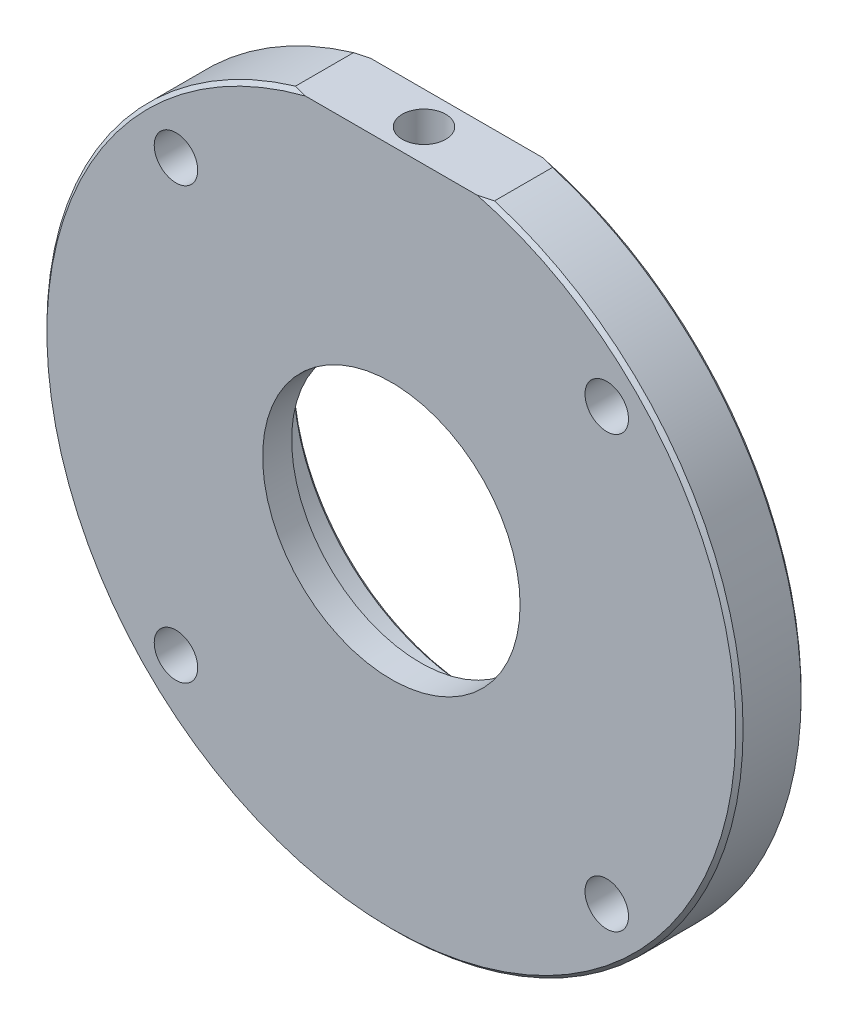
ISO-10303-21;
HEADER;
FILE_DESCRIPTION(('STEP AP214'),'2;1');
FILE_NAME('part.step','',(''),(''),'','','');
FILE_SCHEMA(('AUTOMOTIVE_DESIGN { 1 0 10303 214 1 1 1 1 }'));
ENDSEC;
DATA;
#1=APPLICATION_CONTEXT('core data for automotive mechanical design processes');
#2=APPLICATION_PROTOCOL_DEFINITION('international standard','automotive_design',2000,#1);
#3=PRODUCT_CONTEXT('',#1,'mechanical');
#4=PRODUCT('Part','Part','',(#3));
#5=PRODUCT_RELATED_PRODUCT_CATEGORY('part','',(#4));
#6=PRODUCT_DEFINITION_FORMATION('','',#4);
#7=PRODUCT_DEFINITION_CONTEXT('part definition',#1,'design');
#8=PRODUCT_DEFINITION('design','',#6,#7);
#9=PRODUCT_DEFINITION_SHAPE('','',#8);
#10=(LENGTH_UNIT() NAMED_UNIT(*) SI_UNIT(.MILLI.,.METRE.));
#11=(NAMED_UNIT(*) PLANE_ANGLE_UNIT() SI_UNIT($,.RADIAN.));
#12=(NAMED_UNIT(*) SI_UNIT($,.STERADIAN.) SOLID_ANGLE_UNIT());
#13=UNCERTAINTY_MEASURE_WITH_UNIT(LENGTH_MEASURE(1.E-05),#10,'distance_accuracy_value','');
#14=(GEOMETRIC_REPRESENTATION_CONTEXT(3) GLOBAL_UNCERTAINTY_ASSIGNED_CONTEXT((#13)) GLOBAL_UNIT_ASSIGNED_CONTEXT((#10,
#11,#12)) REPRESENTATION_CONTEXT('',''));
#15=CARTESIAN_POINT('',(0.,0.,0.));
#16=DIRECTION('',(0.,0.,1.));
#17=DIRECTION('',(1.,0.,0.));
#18=AXIS2_PLACEMENT_3D('',#15,#16,#17);
#19=CARTESIAN_POINT('',(0.,0.,0.));
#20=DIRECTION('',(0.,0.,1.));
#21=DIRECTION('',(1.,0.,0.));
#22=AXIS2_PLACEMENT_3D('',#19,#20,#21);
#23=CYLINDRICAL_SURFACE('',#22,17.75);
#24=CARTESIAN_POINT('',(0.,0.,-4.00000000000001));
#25=DIRECTION('',(0.,0.,1.));
#26=DIRECTION('',(1.,0.,0.));
#27=AXIS2_PLACEMENT_3D('',#24,#25,#26);
#28=CIRCLE('',#27,17.75);
#29=CARTESIAN_POINT('',(17.75,0.,-4.00000000000001));
#30=VERTEX_POINT('',#29);
#31=EDGE_CURVE('E209',#30,#30,#28,.T.);
#32=ORIENTED_EDGE('',*,*,#31,.F.);
#33=EDGE_LOOP('',(#32));
#34=FACE_BOUND('',#33,.T.);
#35=CARTESIAN_POINT('',(0.,0.,0.));
#36=DIRECTION('',(0.,0.,1.));
#37=DIRECTION('',(1.,0.,0.));
#38=AXIS2_PLACEMENT_3D('',#35,#36,#37);
#39=CIRCLE('',#38,17.75);
#40=CARTESIAN_POINT('',(17.75,0.,0.));
#41=VERTEX_POINT('',#40);
#42=EDGE_CURVE('E99',#41,#41,#39,.T.);
#43=ORIENTED_EDGE('',*,*,#42,.T.);
#44=EDGE_LOOP('',(#43));
#45=FACE_BOUND('',#44,.T.);
#46=ADVANCED_FACE('F41',(#34,#45),#23,.F.);
#47=CARTESIAN_POINT('',(0.,17.75,0.));
#48=DIRECTION('',(0.,0.,-1.));
#49=DIRECTION('',(-1.,0.,0.));
#50=AXIS2_PLACEMENT_3D('',#47,#48,#49);
#51=PLANE('',#50);
#52=CARTESIAN_POINT('',(29.698484809835,29.698484809835,0.));
#53=DIRECTION('',(0.,0.,-1.));
#54=DIRECTION('',(-1.,0.,0.));
#55=AXIS2_PLACEMENT_3D('',#52,#53,#54);
#56=CIRCLE('',#55,2.99999999999995);
#57=CARTESIAN_POINT('',(26.6984848098351,29.698484809835,0.));
#58=VERTEX_POINT('',#57);
#59=EDGE_CURVE('E308',#58,#58,#56,.T.);
#60=ORIENTED_EDGE('',*,*,#59,.T.);
#61=EDGE_LOOP('',(#60));
#62=FACE_BOUND('',#61,.T.);
#63=CARTESIAN_POINT('',(29.698484809835,-29.698484809835,0.));
#64=DIRECTION('',(0.,0.,-1.));
#65=DIRECTION('',(-1.,0.,0.));
#66=AXIS2_PLACEMENT_3D('',#63,#64,#65);
#67=CIRCLE('',#66,3.00000000000005);
#68=CARTESIAN_POINT('',(26.698484809835,-29.698484809835,0.));
#69=VERTEX_POINT('',#68);
#70=EDGE_CURVE('E302',#69,#69,#67,.T.);
#71=ORIENTED_EDGE('',*,*,#70,.T.);
#72=EDGE_LOOP('',(#71));
#73=FACE_BOUND('',#72,.T.);
#74=CARTESIAN_POINT('',(-29.698484809835,-29.698484809835,0.));
#75=DIRECTION('',(0.,0.,-1.));
#76=DIRECTION('',(-1.,0.,0.));
#77=AXIS2_PLACEMENT_3D('',#74,#75,#76);
#78=CIRCLE('',#77,3.00000000000008);
#79=CARTESIAN_POINT('',(-32.6984848098351,-29.698484809835,0.));
#80=VERTEX_POINT('',#79);
#81=EDGE_CURVE('E296',#80,#80,#78,.T.);
#82=ORIENTED_EDGE('',*,*,#81,.T.);
#83=EDGE_LOOP('',(#82));
#84=FACE_BOUND('',#83,.T.);
#85=CARTESIAN_POINT('',(-29.698484809835,29.698484809835,0.));
#86=DIRECTION('',(0.,0.,-1.));
#87=DIRECTION('',(-1.,0.,0.));
#88=AXIS2_PLACEMENT_3D('',#85,#86,#87);
#89=CIRCLE('',#88,2.99999999999996);
#90=CARTESIAN_POINT('',(-32.698484809835,29.698484809835,0.));
#91=VERTEX_POINT('',#90);
#92=EDGE_CURVE('E210',#91,#91,#89,.T.);
#93=ORIENTED_EDGE('',*,*,#92,.T.);
#94=EDGE_LOOP('',(#93));
#95=FACE_BOUND('',#94,.T.);
#96=ORIENTED_EDGE('',*,*,#42,.F.);
#97=EDGE_LOOP('',(#96));
#98=FACE_BOUND('',#97,.T.);
#99=DIRECTION('',(-1.,0.,0.));
#100=VECTOR('',#99,1.);
#101=CARTESIAN_POINT('',(13.7113092008021,46.,0.));
#102=LINE('',#101,#100);
#103=CARTESIAN_POINT('',(11.8427192823269,46.,0.));
#104=VERTEX_POINT('',#103);
#105=CARTESIAN_POINT('',(-11.8427192823269,46.,0.));
#106=VERTEX_POINT('',#105);
#107=EDGE_CURVE('E232',#104,#106,#102,.T.);
#108=ORIENTED_EDGE('',*,*,#107,.T.);
#109=CARTESIAN_POINT('',(0.,0.,0.));
#110=DIRECTION('',(0.,0.,-1.));
#111=DIRECTION('',(-1.,0.,0.));
#112=AXIS2_PLACEMENT_3D('',#109,#110,#111);
#113=CIRCLE('',#112,47.5);
#114=EDGE_CURVE('E103',#106,#104,#113,.F.);
#115=ORIENTED_EDGE('',*,*,#114,.T.);
#116=EDGE_LOOP('',(#108,#115));
#117=FACE_BOUND('',#116,.T.);
#118=ADVANCED_FACE('F163',(#62,#73,#84,#95,#98,#117),#51,.F.);
#119=CARTESIAN_POINT('',(0.,0.,0.));
#120=DIRECTION('',(0.,0.,1.));
#121=DIRECTION('',(1.,0.,0.));
#122=AXIS2_PLACEMENT_3D('',#119,#120,#121);
#123=CYLINDRICAL_SURFACE('',#122,48.);
#124=DIRECTION('',(0.,0.,-1.));
#125=VECTOR('',#124,1.);
#126=CARTESIAN_POINT('',(13.7113092008021,46.,0.));
#127=LINE('',#126,#125);
#128=CARTESIAN_POINT('',(13.7113092008021,46.,-0.500000000000035));
#129=VERTEX_POINT('',#128);
#130=CARTESIAN_POINT('',(13.7113092008021,46.,-8.50000000000001));
#131=VERTEX_POINT('',#130);
#132=EDGE_CURVE('E234',#129,#131,#127,.T.);
#133=ORIENTED_EDGE('',*,*,#132,.F.);
#134=CARTESIAN_POINT('',(0.,0.,-0.500000000000035));
#135=DIRECTION('',(0.,0.,-1.));
#136=DIRECTION('',(-1.,0.,0.));
#137=AXIS2_PLACEMENT_3D('',#134,#135,#136);
#138=CIRCLE('',#137,48.);
#139=CARTESIAN_POINT('',(-13.7113092008021,46.,-0.500000000000035));
#140=VERTEX_POINT('',#139);
#141=EDGE_CURVE('E239',#129,#140,#138,.T.);
#142=ORIENTED_EDGE('',*,*,#141,.T.);
#143=DIRECTION('',(0.,0.,-1.));
#144=VECTOR('',#143,1.);
#145=CARTESIAN_POINT('',(-13.7113092008021,46.,0.));
#146=LINE('',#145,#144);
#147=CARTESIAN_POINT('',(-13.7113092008021,46.,-8.50000000000001));
#148=VERTEX_POINT('',#147);
#149=EDGE_CURVE('E313',#140,#148,#146,.T.);
#150=ORIENTED_EDGE('',*,*,#149,.T.);
#151=CARTESIAN_POINT('',(0.,0.,-8.50000000000001));
#152=DIRECTION('',(0.,0.,1.));
#153=DIRECTION('',(1.,0.,0.));
#154=AXIS2_PLACEMENT_3D('',#151,#152,#153);
#155=CIRCLE('',#154,48.);
#156=EDGE_CURVE('E240',#148,#131,#155,.T.);
#157=ORIENTED_EDGE('',*,*,#156,.T.);
#158=EDGE_LOOP('',(#133,#142,#150,#157));
#159=FACE_BOUND('',#158,.T.);
#160=ADVANCED_FACE('F167',(#159),#123,.T.);
#161=CARTESIAN_POINT('',(0.,48.,-9.));
#162=DIRECTION('',(0.,0.,1.));
#163=DIRECTION('',(1.,0.,0.));
#164=AXIS2_PLACEMENT_3D('',#161,#162,#163);
#165=PLANE('',#164);
#166=CARTESIAN_POINT('',(29.698484809835,29.698484809835,-9.));
#167=DIRECTION('',(0.,0.,-1.));
#168=DIRECTION('',(-1.,0.,0.));
#169=AXIS2_PLACEMENT_3D('',#166,#167,#168);
#170=CIRCLE('',#169,2.99999999999995);
#171=CARTESIAN_POINT('',(26.6984848098351,29.698484809835,-9.));
#172=VERTEX_POINT('',#171);
#173=EDGE_CURVE('E311',#172,#172,#170,.T.);
#174=ORIENTED_EDGE('',*,*,#173,.F.);
#175=EDGE_LOOP('',(#174));
#176=FACE_BOUND('',#175,.T.);
#177=CARTESIAN_POINT('',(29.698484809835,-29.698484809835,-9.));
#178=DIRECTION('',(0.,0.,-1.));
#179=DIRECTION('',(-1.,0.,0.));
#180=AXIS2_PLACEMENT_3D('',#177,#178,#179);
#181=CIRCLE('',#180,3.00000000000005);
#182=CARTESIAN_POINT('',(26.698484809835,-29.698484809835,-9.));
#183=VERTEX_POINT('',#182);
#184=EDGE_CURVE('E305',#183,#183,#181,.T.);
#185=ORIENTED_EDGE('',*,*,#184,.F.);
#186=EDGE_LOOP('',(#185));
#187=FACE_BOUND('',#186,.T.);
#188=CARTESIAN_POINT('',(-29.698484809835,-29.698484809835,-9.));
#189=DIRECTION('',(0.,0.,-1.));
#190=DIRECTION('',(-1.,0.,0.));
#191=AXIS2_PLACEMENT_3D('',#188,#189,#190);
#192=CIRCLE('',#191,3.00000000000008);
#193=CARTESIAN_POINT('',(-32.6984848098351,-29.698484809835,-9.));
#194=VERTEX_POINT('',#193);
#195=EDGE_CURVE('E299',#194,#194,#192,.T.);
#196=ORIENTED_EDGE('',*,*,#195,.F.);
#197=EDGE_LOOP('',(#196));
#198=FACE_BOUND('',#197,.T.);
#199=CARTESIAN_POINT('',(-29.698484809835,29.698484809835,-9.));
#200=DIRECTION('',(0.,0.,-1.));
#201=DIRECTION('',(-1.,0.,0.));
#202=AXIS2_PLACEMENT_3D('',#199,#200,#201);
#203=CIRCLE('',#202,2.99999999999996);
#204=CARTESIAN_POINT('',(-32.698484809835,29.698484809835,-9.));
#205=VERTEX_POINT('',#204);
#206=EDGE_CURVE('E215',#205,#205,#203,.T.);
#207=ORIENTED_EDGE('',*,*,#206,.F.);
#208=EDGE_LOOP('',(#207));
#209=FACE_BOUND('',#208,.T.);
#210=DIRECTION('',(-1.,0.,0.));
#211=VECTOR('',#210,1.);
#212=CARTESIAN_POINT('',(13.7113092008021,46.,-9.));
#213=LINE('',#212,#211);
#214=CARTESIAN_POINT('',(11.8427192823271,46.,-9.));
#215=VERTEX_POINT('',#214);
#216=CARTESIAN_POINT('',(-11.8427192823271,46.,-9.));
#217=VERTEX_POINT('',#216);
#218=EDGE_CURVE('E235',#215,#217,#213,.T.);
#219=ORIENTED_EDGE('',*,*,#218,.F.);
#220=CARTESIAN_POINT('',(0.,0.,-9.));
#221=DIRECTION('',(0.,0.,1.));
#222=DIRECTION('',(1.,0.,0.));
#223=AXIS2_PLACEMENT_3D('',#220,#221,#222);
#224=CIRCLE('',#223,47.5);
#225=EDGE_CURVE('E242',#215,#217,#224,.F.);
#226=ORIENTED_EDGE('',*,*,#225,.T.);
#227=EDGE_LOOP('',(#219,#226));
#228=FACE_BOUND('',#227,.T.);
#229=CARTESIAN_POINT('',(0.,0.,-9.));
#230=DIRECTION('',(0.,0.,1.));
#231=DIRECTION('',(1.,0.,0.));
#232=AXIS2_PLACEMENT_3D('',#229,#230,#231);
#233=CIRCLE('',#232,36.);
#234=CARTESIAN_POINT('',(36.,0.,-9.));
#235=VERTEX_POINT('',#234);
#236=EDGE_CURVE('E224',#235,#235,#233,.T.);
#237=ORIENTED_EDGE('',*,*,#236,.T.);
#238=EDGE_LOOP('',(#237));
#239=FACE_BOUND('',#238,.T.);
#240=ADVANCED_FACE('F171',(#176,#187,#198,#209,#228,#239),#165,.F.);
#241=CARTESIAN_POINT('',(0.,0.,0.));
#242=DIRECTION('',(0.,0.,1.));
#243=DIRECTION('',(1.,0.,0.));
#244=AXIS2_PLACEMENT_3D('',#241,#242,#243);
#245=CYLINDRICAL_SURFACE('',#244,36.);
#246=CARTESIAN_POINT('',(0.,0.,-13.5));
#247=DIRECTION('',(0.,0.,1.));
#248=DIRECTION('',(1.,0.,0.));
#249=AXIS2_PLACEMENT_3D('',#246,#247,#248);
#250=CIRCLE('',#249,36.);
#251=CARTESIAN_POINT('',(36.,0.,-13.5));
#252=VERTEX_POINT('',#251);
#253=EDGE_CURVE('E50',#252,#252,#250,.T.);
#254=ORIENTED_EDGE('',*,*,#253,.T.);
#255=EDGE_LOOP('',(#254));
#256=FACE_BOUND('',#255,.T.);
#257=ORIENTED_EDGE('',*,*,#236,.F.);
#258=EDGE_LOOP('',(#257));
#259=FACE_BOUND('',#258,.T.);
#260=ADVANCED_FACE('F175',(#256,#259),#245,.T.);
#261=CARTESIAN_POINT('',(0.,36.,-14.));
#262=DIRECTION('',(0.,0.,1.));
#263=DIRECTION('',(1.,0.,0.));
#264=AXIS2_PLACEMENT_3D('',#261,#262,#263);
#265=PLANE('',#264);
#266=CARTESIAN_POINT('',(0.,0.,-14.));
#267=DIRECTION('',(0.,0.,1.));
#268=DIRECTION('',(1.,0.,0.));
#269=AXIS2_PLACEMENT_3D('',#266,#267,#268);
#270=CIRCLE('',#269,35.5);
#271=CARTESIAN_POINT('',(35.5,0.,-14.));
#272=VERTEX_POINT('',#271);
#273=EDGE_CURVE('E11',#272,#272,#270,.F.);
#274=ORIENTED_EDGE('',*,*,#273,.T.);
#275=EDGE_LOOP('',(#274));
#276=FACE_BOUND('',#275,.T.);
#277=CARTESIAN_POINT('',(0.,0.,-14.));
#278=DIRECTION('',(0.,0.,1.));
#279=DIRECTION('',(1.,0.,0.));
#280=AXIS2_PLACEMENT_3D('',#277,#278,#279);
#281=CIRCLE('',#280,30.);
#282=CARTESIAN_POINT('',(30.,0.,-14.));
#283=VERTEX_POINT('',#282);
#284=EDGE_CURVE('E221',#283,#283,#281,.T.);
#285=ORIENTED_EDGE('',*,*,#284,.T.);
#286=EDGE_LOOP('',(#285));
#287=FACE_BOUND('',#286,.T.);
#288=ADVANCED_FACE('F179',(#276,#287),#265,.F.);
#289=CARTESIAN_POINT('',(0.,0.,0.));
#290=DIRECTION('',(0.,0.,1.));
#291=DIRECTION('',(1.,0.,0.));
#292=AXIS2_PLACEMENT_3D('',#289,#290,#291);
#293=CYLINDRICAL_SURFACE('',#292,30.);
#294=ORIENTED_EDGE('',*,*,#284,.F.);
#295=EDGE_LOOP('',(#294));
#296=FACE_BOUND('',#295,.T.);
#297=CARTESIAN_POINT('',(0.,0.,-12.));
#298=DIRECTION('',(0.,0.,1.));
#299=DIRECTION('',(1.,0.,0.));
#300=AXIS2_PLACEMENT_3D('',#297,#298,#299);
#301=CIRCLE('',#300,30.);
#302=CARTESIAN_POINT('',(30.,0.,-12.));
#303=VERTEX_POINT('',#302);
#304=EDGE_CURVE('E212',#303,#303,#301,.T.);
#305=ORIENTED_EDGE('',*,*,#304,.T.);
#306=EDGE_LOOP('',(#305));
#307=FACE_BOUND('',#306,.T.);
#308=ADVANCED_FACE('F183',(#296,#307),#293,.F.);
#309=CARTESIAN_POINT('',(0.,30.,-12.));
#310=DIRECTION('',(0.,0.,1.));
#311=DIRECTION('',(1.,0.,0.));
#312=AXIS2_PLACEMENT_3D('',#309,#310,#311);
#313=PLANE('',#312);
#314=CARTESIAN_POINT('',(0.,0.,-12.));
#315=DIRECTION('',(0.,0.,1.));
#316=DIRECTION('',(1.,0.,0.));
#317=AXIS2_PLACEMENT_3D('',#314,#315,#316);
#318=CIRCLE('',#317,25.5);
#319=CARTESIAN_POINT('',(25.5,0.,-12.));
#320=VERTEX_POINT('',#319);
#321=EDGE_CURVE('E246',#320,#320,#318,.T.);
#322=ORIENTED_EDGE('',*,*,#321,.T.);
#323=EDGE_LOOP('',(#322));
#324=FACE_BOUND('',#323,.T.);
#325=CARTESIAN_POINT('',(0.,28.,-12.));
#326=DIRECTION('',(0.,0.,-1.));
#327=DIRECTION('',(-1.,0.,0.));
#328=AXIS2_PLACEMENT_3D('',#325,#326,#327);
#329=CIRCLE('',#328,1.5);
#330=CARTESIAN_POINT('',(-1.5,28.,-12.));
#331=VERTEX_POINT('',#330);
#332=EDGE_CURVE('E284',#331,#331,#329,.T.);
#333=ORIENTED_EDGE('',*,*,#332,.F.);
#334=EDGE_LOOP('',(#333));
#335=FACE_BOUND('',#334,.T.);
#336=ORIENTED_EDGE('',*,*,#304,.F.);
#337=EDGE_LOOP('',(#336));
#338=FACE_BOUND('',#337,.T.);
#339=ADVANCED_FACE('F187',(#324,#335,#338),#313,.F.);
#340=CARTESIAN_POINT('',(0.,0.,0.));
#341=DIRECTION('',(0.,0.,1.));
#342=DIRECTION('',(1.,0.,0.));
#343=AXIS2_PLACEMENT_3D('',#340,#341,#342);
#344=CYLINDRICAL_SURFACE('',#343,25.);
#345=CARTESIAN_POINT('',(0.,0.,-11.5));
#346=DIRECTION('',(0.,0.,1.));
#347=DIRECTION('',(1.,0.,0.));
#348=AXIS2_PLACEMENT_3D('',#345,#346,#347);
#349=CIRCLE('',#348,25.);
#350=CARTESIAN_POINT('',(25.,0.,-11.5));
#351=VERTEX_POINT('',#350);
#352=EDGE_CURVE('E249',#351,#351,#349,.F.);
#353=ORIENTED_EDGE('',*,*,#352,.T.);
#354=EDGE_LOOP('',(#353));
#355=FACE_BOUND('',#354,.T.);
#356=CARTESIAN_POINT('',(0.,0.,-4.00000000000001));
#357=DIRECTION('',(0.,0.,1.));
#358=DIRECTION('',(1.,0.,0.));
#359=AXIS2_PLACEMENT_3D('',#356,#357,#358);
#360=CIRCLE('',#359,25.);
#361=CARTESIAN_POINT('',(25.,0.,-4.00000000000001));
#362=VERTEX_POINT('',#361);
#363=EDGE_CURVE('E206',#362,#362,#360,.T.);
#364=ORIENTED_EDGE('',*,*,#363,.T.);
#365=EDGE_LOOP('',(#364));
#366=FACE_BOUND('',#365,.T.);
#367=ADVANCED_FACE('F191',(#355,#366),#344,.F.);
#368=CARTESIAN_POINT('',(0.,25.,-4.00000000000001));
#369=DIRECTION('',(0.,0.,1.));
#370=DIRECTION('',(1.,0.,0.));
#371=AXIS2_PLACEMENT_3D('',#368,#369,#370);
#372=PLANE('',#371);
#373=ORIENTED_EDGE('',*,*,#363,.F.);
#374=EDGE_LOOP('',(#373));
#375=FACE_BOUND('',#374,.T.);
#376=ORIENTED_EDGE('',*,*,#31,.T.);
#377=EDGE_LOOP('',(#376));
#378=FACE_BOUND('',#377,.T.);
#379=ADVANCED_FACE('F194',(#375,#378),#372,.F.);
#380=CARTESIAN_POINT('',(-29.698484809835,29.698484809835,0.));
#381=DIRECTION('',(0.,0.,-1.));
#382=DIRECTION('',(-1.,0.,0.));
#383=AXIS2_PLACEMENT_3D('',#380,#381,#382);
#384=CYLINDRICAL_SURFACE('',#383,2.99999999999996);
#385=ORIENTED_EDGE('',*,*,#92,.F.);
#386=EDGE_LOOP('',(#385));
#387=FACE_BOUND('',#386,.T.);
#388=ORIENTED_EDGE('',*,*,#206,.T.);
#389=EDGE_LOOP('',(#388));
#390=FACE_BOUND('',#389,.T.);
#391=ADVANCED_FACE('F135',(#387,#390),#384,.F.);
#392=CARTESIAN_POINT('',(-29.698484809835,-29.698484809835,0.));
#393=DIRECTION('',(0.,0.,-1.));
#394=DIRECTION('',(-1.,0.,0.));
#395=AXIS2_PLACEMENT_3D('',#392,#393,#394);
#396=CYLINDRICAL_SURFACE('',#395,3.00000000000008);
#397=ORIENTED_EDGE('',*,*,#81,.F.);
#398=EDGE_LOOP('',(#397));
#399=FACE_BOUND('',#398,.T.);
#400=ORIENTED_EDGE('',*,*,#195,.T.);
#401=EDGE_LOOP('',(#400));
#402=FACE_BOUND('',#401,.T.);
#403=ADVANCED_FACE('F201',(#399,#402),#396,.F.);
#404=CARTESIAN_POINT('',(29.698484809835,-29.698484809835,0.));
#405=DIRECTION('',(0.,0.,-1.));
#406=DIRECTION('',(-1.,0.,0.));
#407=AXIS2_PLACEMENT_3D('',#404,#405,#406);
#408=CYLINDRICAL_SURFACE('',#407,3.00000000000005);
#409=ORIENTED_EDGE('',*,*,#70,.F.);
#410=EDGE_LOOP('',(#409));
#411=FACE_BOUND('',#410,.T.);
#412=ORIENTED_EDGE('',*,*,#184,.T.);
#413=EDGE_LOOP('',(#412));
#414=FACE_BOUND('',#413,.T.);
#415=ADVANCED_FACE('F336',(#411,#414),#408,.F.);
#416=CARTESIAN_POINT('',(29.698484809835,29.698484809835,0.));
#417=DIRECTION('',(0.,0.,-1.));
#418=DIRECTION('',(-1.,0.,0.));
#419=AXIS2_PLACEMENT_3D('',#416,#417,#418);
#420=CYLINDRICAL_SURFACE('',#419,2.99999999999995);
#421=ORIENTED_EDGE('',*,*,#59,.F.);
#422=EDGE_LOOP('',(#421));
#423=FACE_BOUND('',#422,.T.);
#424=ORIENTED_EDGE('',*,*,#173,.T.);
#425=EDGE_LOOP('',(#424));
#426=FACE_BOUND('',#425,.T.);
#427=ADVANCED_FACE('F132',(#423,#426),#420,.F.);
#428=CARTESIAN_POINT('',(13.7113092008021,46.,0.));
#429=DIRECTION('',(0.,-1.,0.));
#430=DIRECTION('',(0.,0.,-1.));
#431=AXIS2_PLACEMENT_3D('',#428,#429,#430);
#432=PLANE('',#431);
#433=CARTESIAN_POINT('',(0.,46.,-4.5));
#434=DIRECTION('',(0.,1.,0.));
#435=DIRECTION('',(0.,0.,1.));
#436=AXIS2_PLACEMENT_3D('',#433,#434,#435);
#437=CIRCLE('',#436,3.);
#438=CARTESIAN_POINT('',(0.,46.,-1.5));
#439=VERTEX_POINT('',#438);
#440=EDGE_CURVE('E365',#439,#439,#437,.T.);
#441=ORIENTED_EDGE('',*,*,#440,.F.);
#442=EDGE_LOOP('',(#441));
#443=FACE_BOUND('',#442,.T.);
#444=ORIENTED_EDGE('',*,*,#107,.F.);
#445=CARTESIAN_POINT('',(11.8427192823269,46.,0.));
#446=CARTESIAN_POINT('',(11.9991388188031,46.,-0.0389985230280838));
#447=CARTESIAN_POINT('',(12.1553880653659,46.,-0.0786793241775536));
#448=CARTESIAN_POINT('',(12.4675283278574,46.,-0.159380356325894));
#449=CARTESIAN_POINT('',(12.6234193687162,46.,-0.200400490890134));
#450=CARTESIAN_POINT('',(12.9348478472471,46.,-0.283760620168467));
#451=CARTESIAN_POINT('',(13.0903852853711,46.,-0.326100613194369));
#452=CARTESIAN_POINT('',(13.4011123370387,46.,-0.412081144543513));
#453=CARTESIAN_POINT('',(13.5563019247885,46.,-0.45572177609113));
#454=CARTESIAN_POINT('',(13.7113092008021,46.,-0.500000000000035));
#455=B_SPLINE_CURVE_WITH_KNOTS('',3,(#445,#446,#447,#448,#449,#450,#451,#452,#453,#454),
.UNSPECIFIED.,.F.,.F.,(4,2,2,2,4),(0.,0.483621622500473,0.967208499754799,1.45079475849337,
1.93441576244599),.UNSPECIFIED.);
#456=EDGE_CURVE('E65',#104,#129,#455,.T.);
#457=ORIENTED_EDGE('',*,*,#456,.T.);
#458=ORIENTED_EDGE('',*,*,#132,.T.);
#459=CARTESIAN_POINT('',(13.7113092008021,46.,-8.50000000000001));
#460=CARTESIAN_POINT('',(13.5563019247885,46.,-8.5442782239089));
#461=CARTESIAN_POINT('',(13.4011123370387,46.,-8.58791885545652));
#462=CARTESIAN_POINT('',(13.0903852853711,46.,-8.67389938680565));
#463=CARTESIAN_POINT('',(12.9348478472471,46.,-8.71623937983155));
#464=CARTESIAN_POINT('',(12.6234193687163,46.,-8.79959950910987));
#465=CARTESIAN_POINT('',(12.4675283278575,46.,-8.84061964367411));
#466=CARTESIAN_POINT('',(12.155388065366,46.,-8.92132067582244));
#467=CARTESIAN_POINT('',(11.9991388188032,46.,-8.96100147697191));
#468=CARTESIAN_POINT('',(11.8427192823271,46.,-8.99999999999999));
#469=B_SPLINE_CURVE_WITH_KNOTS('',3,(#459,#460,#461,#462,#463,#464,#465,#466,#467,#468),
.UNSPECIFIED.,.F.,.F.,(4,2,2,2,4),(0.,0.483621003952566,0.967207262691103,1.45079413994539,
1.93441576244582),.UNSPECIFIED.);
#470=EDGE_CURVE('E57',#131,#215,#469,.T.);
#471=ORIENTED_EDGE('',*,*,#470,.T.);
#472=ORIENTED_EDGE('',*,*,#218,.T.);
#473=CARTESIAN_POINT('',(-11.8427192823271,46.,-9.));
#474=CARTESIAN_POINT('',(-11.9991388188032,46.,-8.96100147697191));
#475=CARTESIAN_POINT('',(-12.155388065366,46.,-8.92132067582244));
#476=CARTESIAN_POINT('',(-12.4675283278575,46.,-8.84061964367411));
#477=CARTESIAN_POINT('',(-12.6234193687163,46.,-8.79959950910987));
#478=CARTESIAN_POINT('',(-12.9348478472471,46.,-8.71623937983155));
#479=CARTESIAN_POINT('',(-13.0903852853711,46.,-8.67389938680565));
#480=CARTESIAN_POINT('',(-13.4011123370387,46.,-8.58791885545652));
#481=CARTESIAN_POINT('',(-13.5563019247885,46.,-8.5442782239089));
#482=CARTESIAN_POINT('',(-13.7113092008021,46.,-8.50000000000001));
#483=B_SPLINE_CURVE_WITH_KNOTS('',3,(#473,#474,#475,#476,#477,#478,#479,#480,#481,#482),
.UNSPECIFIED.,.F.,.F.,(4,2,2,2,4),(0.,0.483621622500432,0.967208499754714,1.45079475849325,
1.93441576244582),.UNSPECIFIED.);
#484=EDGE_CURVE('E106',#217,#148,#483,.T.);
#485=ORIENTED_EDGE('',*,*,#484,.T.);
#486=ORIENTED_EDGE('',*,*,#149,.F.);
#487=CARTESIAN_POINT('',(-13.7113092008021,46.,-0.500000000000035));
#488=CARTESIAN_POINT('',(-13.5563019247885,46.,-0.45572177609113));
#489=CARTESIAN_POINT('',(-13.4011123370387,46.,-0.412081144543513));
#490=CARTESIAN_POINT('',(-13.0903852853711,46.,-0.326100613194369));
#491=CARTESIAN_POINT('',(-12.9348478472471,46.,-0.283760620168467));
#492=CARTESIAN_POINT('',(-12.6234193687162,46.,-0.200400490890134));
#493=CARTESIAN_POINT('',(-12.4675283278574,46.,-0.159380356325894));
#494=CARTESIAN_POINT('',(-12.1553880653659,46.,-0.0786793241775533));
#495=CARTESIAN_POINT('',(-11.9991388188031,46.,-0.0389985230280822));
#496=CARTESIAN_POINT('',(-11.8427192823269,46.,0.));
#497=B_SPLINE_CURVE_WITH_KNOTS('',3,(#487,#488,#489,#490,#491,#492,#493,#494,#495,#496),
.UNSPECIFIED.,.F.,.F.,(4,2,2,2,4),(0.,0.483621003952611,0.967207262691188,1.45079413994552,
1.93441576244599),.UNSPECIFIED.);
#498=EDGE_CURVE('E141',#140,#106,#497,.T.);
#499=ORIENTED_EDGE('',*,*,#498,.T.);
#500=EDGE_LOOP('',(#444,#457,#458,#471,#472,#485,#486,#499));
#501=FACE_BOUND('',#500,.T.);
#502=ADVANCED_FACE('F126',(#443,#501),#432,.F.);
#503=CARTESIAN_POINT('',(0.,28.,-1.90129092854134));
#504=DIRECTION('',(0.,0.,-1.));
#505=DIRECTION('',(-1.,0.,0.));
#506=AXIS2_PLACEMENT_3D('',#503,#504,#505);
#507=CONICAL_SURFACE('',#506,1.5,1.02974425867665);
#508=CARTESIAN_POINT('',(0.,28.,-1.));
#509=VERTEX_POINT('',#508);
#510=VERTEX_LOOP('',#509);
#511=FACE_BOUND('',#510,.T.);
#512=CARTESIAN_POINT('',(0.,28.,-1.90129092854134));
#513=DIRECTION('',(0.,0.,-1.));
#514=DIRECTION('',(-1.,0.,0.));
#515=AXIS2_PLACEMENT_3D('',#512,#513,#514);
#516=CIRCLE('',#515,1.5);
#517=CARTESIAN_POINT('',(-1.5,28.,-1.90129092854134));
#518=VERTEX_POINT('',#517);
#519=EDGE_CURVE('E286',#518,#518,#516,.T.);
#520=ORIENTED_EDGE('',*,*,#519,.T.);
#521=EDGE_LOOP('',(#520));
#522=FACE_BOUND('',#521,.T.);
#523=ADVANCED_FACE('F131',(#511,#522),#507,.F.);
#524=CARTESIAN_POINT('',(0.,28.,-12.));
#525=DIRECTION('',(0.,0.,-1.));
#526=DIRECTION('',(-1.,0.,0.));
#527=AXIS2_PLACEMENT_3D('',#524,#525,#526);
#528=CYLINDRICAL_SURFACE('',#527,1.5);
#529=CARTESIAN_POINT('',(0.,28.,-4.5));
#530=DIRECTION('',(0.,-0.707106781186547,-0.707106781186547));
#531=DIRECTION('',(0.,0.707106781186547,-0.707106781186547));
#532=AXIS2_PLACEMENT_3D('',#529,#530,#531);
#533=ELLIPSE('',#532,2.12132034355964,1.5);
#534=CARTESIAN_POINT('',(1.5,28.,-4.5));
#535=VERTEX_POINT('',#534);
#536=CARTESIAN_POINT('',(-1.5,28.,-4.5));
#537=VERTEX_POINT('',#536);
#538=EDGE_CURVE('E93',#535,#537,#533,.F.);
#539=ORIENTED_EDGE('',*,*,#538,.T.);
#540=CARTESIAN_POINT('',(0.,28.,-4.5));
#541=DIRECTION('',(0.,0.707106781186547,-0.707106781186547));
#542=DIRECTION('',(0.,-0.707106781186547,-0.707106781186547));
#543=AXIS2_PLACEMENT_3D('',#540,#541,#542);
#544=ELLIPSE('',#543,2.12132034355964,1.5);
#545=EDGE_CURVE('E97',#537,#535,#544,.T.);
#546=ORIENTED_EDGE('',*,*,#545,.T.);
#547=EDGE_LOOP('',(#539,#546));
#548=FACE_BOUND('',#547,.T.);
#549=ORIENTED_EDGE('',*,*,#519,.F.);
#550=EDGE_LOOP('',(#549));
#551=FACE_BOUND('',#550,.T.);
#552=ORIENTED_EDGE('',*,*,#332,.T.);
#553=EDGE_LOOP('',(#552));
#554=FACE_BOUND('',#553,.T.);
#555=ADVANCED_FACE('F101',(#548,#551,#554),#528,.F.);
#556=CARTESIAN_POINT('',(0.,46.,-4.5));
#557=DIRECTION('',(0.,1.,0.));
#558=DIRECTION('',(0.,0.,1.));
#559=AXIS2_PLACEMENT_3D('',#556,#557,#558);
#560=CYLINDRICAL_SURFACE('',#559,1.5);
#561=ORIENTED_EDGE('',*,*,#538,.F.);
#562=ORIENTED_EDGE('',*,*,#545,.F.);
#563=EDGE_LOOP('',(#561,#562));
#564=FACE_BOUND('',#563,.T.);
#565=CARTESIAN_POINT('',(0.,39.,-4.5));
#566=DIRECTION('',(0.,1.,0.));
#567=DIRECTION('',(0.,0.,1.));
#568=AXIS2_PLACEMENT_3D('',#565,#566,#567);
#569=CIRCLE('',#568,1.5);
#570=CARTESIAN_POINT('',(0.,39.,-3.));
#571=VERTEX_POINT('',#570);
#572=EDGE_CURVE('E287',#571,#571,#569,.T.);
#573=ORIENTED_EDGE('',*,*,#572,.T.);
#574=EDGE_LOOP('',(#573));
#575=FACE_BOUND('',#574,.T.);
#576=ADVANCED_FACE('F95',(#564,#575),#560,.F.);
#577=CARTESIAN_POINT('',(1.5,39.,-4.5));
#578=DIRECTION('',(0.,-1.,0.));
#579=DIRECTION('',(0.,0.,-1.));
#580=AXIS2_PLACEMENT_3D('',#577,#578,#579);
#581=PLANE('',#580);
#582=ORIENTED_EDGE('',*,*,#572,.F.);
#583=EDGE_LOOP('',(#582));
#584=FACE_BOUND('',#583,.T.);
#585=CARTESIAN_POINT('',(0.,39.,-4.5));
#586=DIRECTION('',(0.,1.,0.));
#587=DIRECTION('',(0.,0.,1.));
#588=AXIS2_PLACEMENT_3D('',#585,#586,#587);
#589=CIRCLE('',#588,3.);
#590=CARTESIAN_POINT('',(0.,39.,-1.5));
#591=VERTEX_POINT('',#590);
#592=EDGE_CURVE('E292',#591,#591,#589,.T.);
#593=ORIENTED_EDGE('',*,*,#592,.T.);
#594=EDGE_LOOP('',(#593));
#595=FACE_BOUND('',#594,.T.);
#596=ADVANCED_FACE('F352',(#584,#595),#581,.F.);
#597=CARTESIAN_POINT('',(0.,46.,-4.5));
#598=DIRECTION('',(0.,1.,0.));
#599=DIRECTION('',(0.,0.,1.));
#600=AXIS2_PLACEMENT_3D('',#597,#598,#599);
#601=CYLINDRICAL_SURFACE('',#600,3.);
#602=ORIENTED_EDGE('',*,*,#592,.F.);
#603=EDGE_LOOP('',(#602));
#604=FACE_BOUND('',#603,.T.);
#605=ORIENTED_EDGE('',*,*,#440,.T.);
#606=EDGE_LOOP('',(#605));
#607=FACE_BOUND('',#606,.T.);
#608=ADVANCED_FACE('F158',(#604,#607),#601,.F.);
#609=CARTESIAN_POINT('',(0.,0.,0.));
#610=DIRECTION('',(0.,0.,-1.));
#611=DIRECTION('',(-1.,0.,0.));
#612=AXIS2_PLACEMENT_3D('',#609,#610,#611);
#613=CONICAL_SURFACE('',#612,47.5,0.785398163397441);
#614=ORIENTED_EDGE('',*,*,#498,.F.);
#615=ORIENTED_EDGE('',*,*,#141,.F.);
#616=ORIENTED_EDGE('',*,*,#456,.F.);
#617=ORIENTED_EDGE('',*,*,#114,.F.);
#618=EDGE_LOOP('',(#614,#615,#616,#617));
#619=FACE_BOUND('',#618,.T.);
#620=ADVANCED_FACE('F152',(#619),#613,.T.);
#621=CARTESIAN_POINT('',(0.,0.,-8.50000000000001));
#622=DIRECTION('',(0.,0.,1.));
#623=DIRECTION('',(1.,0.,0.));
#624=AXIS2_PLACEMENT_3D('',#621,#622,#623);
#625=CONICAL_SURFACE('',#624,48.,0.785398163397455);
#626=ORIENTED_EDGE('',*,*,#484,.F.);
#627=ORIENTED_EDGE('',*,*,#225,.F.);
#628=ORIENTED_EDGE('',*,*,#470,.F.);
#629=ORIENTED_EDGE('',*,*,#156,.F.);
#630=EDGE_LOOP('',(#626,#627,#628,#629));
#631=FACE_BOUND('',#630,.T.);
#632=ADVANCED_FACE('F123',(#631),#625,.T.);
#633=CARTESIAN_POINT('',(0.,0.,-12.));
#634=DIRECTION('',(0.,0.,-1.));
#635=DIRECTION('',(-1.,0.,0.));
#636=AXIS2_PLACEMENT_3D('',#633,#634,#635);
#637=CONICAL_SURFACE('',#636,25.5,0.785398163397435);
#638=ORIENTED_EDGE('',*,*,#352,.F.);
#639=EDGE_LOOP('',(#638));
#640=FACE_BOUND('',#639,.T.);
#641=ORIENTED_EDGE('',*,*,#321,.F.);
#642=EDGE_LOOP('',(#641));
#643=FACE_BOUND('',#642,.T.);
#644=ADVANCED_FACE('F256',(#640,#643),#637,.F.);
#645=CARTESIAN_POINT('',(0.,0.,-13.5));
#646=DIRECTION('',(0.,0.,1.));
#647=DIRECTION('',(1.,0.,0.));
#648=AXIS2_PLACEMENT_3D('',#645,#646,#647);
#649=CONICAL_SURFACE('',#648,36.,0.785398163397462);
#650=ORIENTED_EDGE('',*,*,#273,.F.);
#651=EDGE_LOOP('',(#650));
#652=FACE_BOUND('',#651,.T.);
#653=ORIENTED_EDGE('',*,*,#253,.F.);
#654=EDGE_LOOP('',(#653));
#655=FACE_BOUND('',#654,.T.);
#656=ADVANCED_FACE('F44',(#652,#655),#649,.T.);
#657=CLOSED_SHELL('',(#46,#118,#160,#240,#260,#288,#308,#339,#367,#379,#391,#403,#415,#427,#502,
#523,#555,#576,#596,#608,#620,#632,#644,#656));
#658=MANIFOLD_SOLID_BREP('B2',#657);
#659=ADVANCED_BREP_SHAPE_REPRESENTATION('',(#18,#658),#14);
#660=SHAPE_DEFINITION_REPRESENTATION(#9,#659);
ENDSEC;
END-ISO-10303-21;
